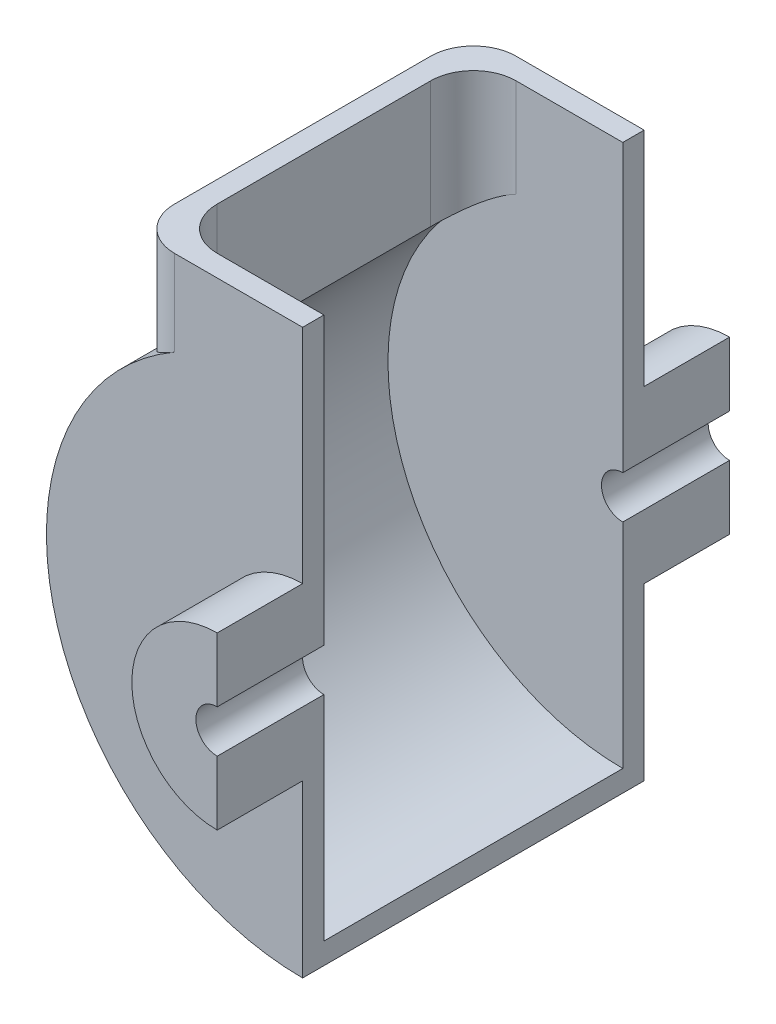
ISO-10303-21;
HEADER;
FILE_DESCRIPTION(('STEP AP214'),'2;1');
FILE_NAME('part.step','',(''),(''),'','','');
FILE_SCHEMA(('AUTOMOTIVE_DESIGN { 1 0 10303 214 1 1 1 1 }'));
ENDSEC;
DATA;
#1=APPLICATION_CONTEXT('core data for automotive mechanical design processes');
#2=APPLICATION_PROTOCOL_DEFINITION('international standard','automotive_design',2000,#1);
#3=PRODUCT_CONTEXT('',#1,'mechanical');
#4=PRODUCT('Part','Part','',(#3));
#5=PRODUCT_RELATED_PRODUCT_CATEGORY('part','',(#4));
#6=PRODUCT_DEFINITION_FORMATION('','',#4);
#7=PRODUCT_DEFINITION_CONTEXT('part definition',#1,'design');
#8=PRODUCT_DEFINITION('design','',#6,#7);
#9=PRODUCT_DEFINITION_SHAPE('','',#8);
#10=(LENGTH_UNIT() NAMED_UNIT(*) SI_UNIT(.MILLI.,.METRE.));
#11=(NAMED_UNIT(*) PLANE_ANGLE_UNIT() SI_UNIT($,.RADIAN.));
#12=(NAMED_UNIT(*) SI_UNIT($,.STERADIAN.) SOLID_ANGLE_UNIT());
#13=UNCERTAINTY_MEASURE_WITH_UNIT(LENGTH_MEASURE(1.E-05),#10,'distance_accuracy_value','');
#14=(GEOMETRIC_REPRESENTATION_CONTEXT(3) GLOBAL_UNCERTAINTY_ASSIGNED_CONTEXT((#13)) GLOBAL_UNIT_ASSIGNED_CONTEXT((#10,
#11,#12)) REPRESENTATION_CONTEXT('',''));
#15=CARTESIAN_POINT('',(0.,0.,0.));
#16=DIRECTION('',(0.,0.,1.));
#17=DIRECTION('',(1.,0.,0.));
#18=AXIS2_PLACEMENT_3D('',#15,#16,#17);
#19=CARTESIAN_POINT('',(0.,0.,0.));
#20=DIRECTION('',(0.,0.,1.));
#21=DIRECTION('',(1.,0.,0.));
#22=AXIS2_PLACEMENT_3D('',#19,#20,#21);
#23=PLANE('',#22);
#24=CARTESIAN_POINT('',(0.,0.,0.));
#25=DIRECTION('',(0.,0.,-1.));
#26=DIRECTION('',(-1.,0.,0.));
#27=AXIS2_PLACEMENT_3D('',#24,#25,#26);
#28=CIRCLE('',#27,55.);
#29=CARTESIAN_POINT('',(-25.,48.9897948556636,0.));
#30=VERTEX_POINT('',#29);
#31=CARTESIAN_POINT('',(0.,-55.,0.));
#32=VERTEX_POINT('',#31);
#33=EDGE_CURVE('E238',#30,#32,#28,.F.);
#34=ORIENTED_EDGE('',*,*,#33,.F.);
#35=DIRECTION('',(0.,-1.,0.));
#36=VECTOR('',#35,1.);
#37=CARTESIAN_POINT('',(-25.,72.,0.));
#38=LINE('',#37,#36);
#39=CARTESIAN_POINT('',(-25.,72.,0.));
#40=VERTEX_POINT('',#39);
#41=EDGE_CURVE('E312',#30,#40,#38,.F.);
#42=ORIENTED_EDGE('',*,*,#41,.T.);
#43=DIRECTION('',(-1.,0.,0.));
#44=VECTOR('',#43,1.);
#45=CARTESIAN_POINT('',(0.,72.,0.));
#46=LINE('',#45,#44);
#47=CARTESIAN_POINT('',(0.,72.,0.));
#48=VERTEX_POINT('',#47);
#49=EDGE_CURVE('E241',#48,#40,#46,.T.);
#50=ORIENTED_EDGE('',*,*,#49,.F.);
#51=DIRECTION('',(0.,1.,0.));
#52=VECTOR('',#51,1.);
#53=CARTESIAN_POINT('',(0.,20.,0.));
#54=LINE('',#53,#52);
#55=CARTESIAN_POINT('',(0.,5.,0.));
#56=VERTEX_POINT('',#55);
#57=EDGE_CURVE('E291',#56,#48,#54,.T.);
#58=ORIENTED_EDGE('',*,*,#57,.F.);
#59=CARTESIAN_POINT('',(0.,0.,0.));
#60=DIRECTION('',(0.,0.,-1.));
#61=DIRECTION('',(1.,0.,0.));
#62=AXIS2_PLACEMENT_3D('',#59,#60,#61);
#63=CIRCLE('',#62,5.);
#64=CARTESIAN_POINT('',(0.,-5.,0.));
#65=VERTEX_POINT('',#64);
#66=EDGE_CURVE('E277',#65,#56,#63,.T.);
#67=ORIENTED_EDGE('',*,*,#66,.F.);
#68=DIRECTION('',(0.,1.,0.));
#69=VECTOR('',#68,1.);
#70=CARTESIAN_POINT('',(0.,-5.,0.));
#71=LINE('',#70,#69);
#72=EDGE_CURVE('E282',#32,#65,#71,.T.);
#73=ORIENTED_EDGE('',*,*,#72,.F.);
#74=EDGE_LOOP('',(#34,#42,#50,#58,#67,#73));
#75=FACE_BOUND('',#74,.T.);
#76=ADVANCED_FACE('F33',(#75),#23,.F.);
#77=CARTESIAN_POINT('',(0.,0.,25.));
#78=DIRECTION('',(0.,0.,-1.));
#79=DIRECTION('',(-1.,0.,0.));
#80=AXIS2_PLACEMENT_3D('',#77,#78,#79);
#81=CYLINDRICAL_SURFACE('',#80,5.);
#82=ORIENTED_EDGE('',*,*,#66,.T.);
#83=DIRECTION('',(0.,0.,-1.));
#84=VECTOR('',#83,1.);
#85=CARTESIAN_POINT('',(0.,5.,25.));
#86=LINE('',#85,#84);
#87=CARTESIAN_POINT('',(0.,5.,25.));
#88=VERTEX_POINT('',#87);
#89=EDGE_CURVE('E301',#88,#56,#86,.T.);
#90=ORIENTED_EDGE('',*,*,#89,.F.);
#91=CARTESIAN_POINT('',(0.,0.,25.));
#92=DIRECTION('',(0.,0.,-1.));
#93=DIRECTION('',(1.,0.,0.));
#94=AXIS2_PLACEMENT_3D('',#91,#92,#93);
#95=CIRCLE('',#94,5.);
#96=CARTESIAN_POINT('',(0.,-5.,25.));
#97=VERTEX_POINT('',#96);
#98=EDGE_CURVE('E278',#97,#88,#95,.T.);
#99=ORIENTED_EDGE('',*,*,#98,.F.);
#100=DIRECTION('',(0.,0.,-1.));
#101=VECTOR('',#100,1.);
#102=CARTESIAN_POINT('',(0.,-5.,25.));
#103=LINE('',#102,#101);
#104=EDGE_CURVE('E288',#97,#65,#103,.T.);
#105=ORIENTED_EDGE('',*,*,#104,.T.);
#106=EDGE_LOOP('',(#82,#90,#99,#105));
#107=FACE_BOUND('',#106,.T.);
#108=ADVANCED_FACE('F347',(#107),#81,.F.);
#109=CARTESIAN_POINT('',(0.,20.,25.));
#110=DIRECTION('',(-1.,0.,0.));
#111=DIRECTION('',(0.,-1.,0.));
#112=AXIS2_PLACEMENT_3D('',#109,#110,#111);
#113=PLANE('',#112);
#114=ORIENTED_EDGE('',*,*,#57,.T.);
#115=DIRECTION('',(0.,0.,-1.));
#116=VECTOR('',#115,1.);
#117=CARTESIAN_POINT('',(0.,72.,5.));
#118=LINE('',#117,#116);
#119=CARTESIAN_POINT('',(0.,72.,5.));
#120=VERTEX_POINT('',#119);
#121=EDGE_CURVE('E274',#120,#48,#118,.T.);
#122=ORIENTED_EDGE('',*,*,#121,.F.);
#123=DIRECTION('',(0.,1.,0.));
#124=VECTOR('',#123,1.);
#125=CARTESIAN_POINT('',(0.,20.,5.));
#126=LINE('',#125,#124);
#127=CARTESIAN_POINT('',(0.,20.,5.));
#128=VERTEX_POINT('',#127);
#129=EDGE_CURVE('E256',#128,#120,#126,.T.);
#130=ORIENTED_EDGE('',*,*,#129,.F.);
#131=DIRECTION('',(0.,0.,-1.));
#132=VECTOR('',#131,1.);
#133=CARTESIAN_POINT('',(0.,20.,25.));
#134=LINE('',#133,#132);
#135=CARTESIAN_POINT('',(0.,20.,25.));
#136=VERTEX_POINT('',#135);
#137=EDGE_CURVE('E299',#136,#128,#134,.T.);
#138=ORIENTED_EDGE('',*,*,#137,.F.);
#139=DIRECTION('',(0.,1.,0.));
#140=VECTOR('',#139,1.);
#141=CARTESIAN_POINT('',(0.,20.,25.));
#142=LINE('',#141,#140);
#143=EDGE_CURVE('E281',#88,#136,#142,.T.);
#144=ORIENTED_EDGE('',*,*,#143,.F.);
#145=ORIENTED_EDGE('',*,*,#89,.T.);
#146=EDGE_LOOP('',(#114,#122,#130,#138,#144,#145));
#147=FACE_BOUND('',#146,.T.);
#148=ADVANCED_FACE('F393',(#147),#113,.F.);
#149=CARTESIAN_POINT('',(0.,0.,25.));
#150=DIRECTION('',(0.,0.,-1.));
#151=DIRECTION('',(-1.,0.,0.));
#152=AXIS2_PLACEMENT_3D('',#149,#150,#151);
#153=CYLINDRICAL_SURFACE('',#152,20.);
#154=ORIENTED_EDGE('',*,*,#137,.T.);
#155=CARTESIAN_POINT('',(0.,0.,5.));
#156=DIRECTION('',(0.,0.,-1.));
#157=DIRECTION('',(1.,0.,0.));
#158=AXIS2_PLACEMENT_3D('',#155,#156,#157);
#159=CIRCLE('',#158,20.);
#160=CARTESIAN_POINT('',(0.,-20.,5.));
#161=VERTEX_POINT('',#160);
#162=EDGE_CURVE('E253',#161,#128,#159,.T.);
#163=ORIENTED_EDGE('',*,*,#162,.F.);
#164=DIRECTION('',(0.,0.,-1.));
#165=VECTOR('',#164,1.);
#166=CARTESIAN_POINT('',(0.,-20.,25.));
#167=LINE('',#166,#165);
#168=CARTESIAN_POINT('',(0.,-20.,25.));
#169=VERTEX_POINT('',#168);
#170=EDGE_CURVE('E296',#169,#161,#167,.T.);
#171=ORIENTED_EDGE('',*,*,#170,.F.);
#172=CARTESIAN_POINT('',(0.,0.,25.));
#173=DIRECTION('',(0.,0.,1.));
#174=DIRECTION('',(1.,0.,0.));
#175=AXIS2_PLACEMENT_3D('',#172,#173,#174);
#176=CIRCLE('',#175,20.);
#177=EDGE_CURVE('E284',#136,#169,#176,.T.);
#178=ORIENTED_EDGE('',*,*,#177,.F.);
#179=EDGE_LOOP('',(#154,#163,#171,#178));
#180=FACE_BOUND('',#179,.T.);
#181=ADVANCED_FACE('F390',(#180),#153,.T.);
#182=CARTESIAN_POINT('',(0.,-5.,25.));
#183=DIRECTION('',(-1.,0.,0.));
#184=DIRECTION('',(0.,-1.,0.));
#185=AXIS2_PLACEMENT_3D('',#182,#183,#184);
#186=PLANE('',#185);
#187=DIRECTION('',(0.,0.,-1.));
#188=VECTOR('',#187,1.);
#189=CARTESIAN_POINT('',(0.,-60.,5.));
#190=LINE('',#189,#188);
#191=CARTESIAN_POINT('',(0.,-60.,5.));
#192=VERTEX_POINT('',#191);
#193=CARTESIAN_POINT('',(0.,-60.,-75.));
#194=VERTEX_POINT('',#193);
#195=EDGE_CURVE('E264',#192,#194,#190,.T.);
#196=ORIENTED_EDGE('',*,*,#195,.T.);
#197=DIRECTION('',(0.,1.,0.));
#198=VECTOR('',#197,1.);
#199=CARTESIAN_POINT('',(0.,-20.,-75.));
#200=LINE('',#199,#198);
#201=CARTESIAN_POINT('',(0.,-20.,-75.));
#202=VERTEX_POINT('',#201);
#203=EDGE_CURVE('E197',#194,#202,#200,.T.);
#204=ORIENTED_EDGE('',*,*,#203,.T.);
#205=DIRECTION('',(0.,0.,1.));
#206=VECTOR('',#205,1.);
#207=CARTESIAN_POINT('',(0.,-20.,-95.));
#208=LINE('',#207,#206);
#209=CARTESIAN_POINT('',(0.,-20.,-95.));
#210=VERTEX_POINT('',#209);
#211=EDGE_CURVE('E230',#210,#202,#208,.T.);
#212=ORIENTED_EDGE('',*,*,#211,.F.);
#213=DIRECTION('',(0.,1.,0.));
#214=VECTOR('',#213,1.);
#215=CARTESIAN_POINT('',(0.,-5.,-95.));
#216=LINE('',#215,#214);
#217=CARTESIAN_POINT('',(0.,-5.,-95.));
#218=VERTEX_POINT('',#217);
#219=EDGE_CURVE('E220',#210,#218,#216,.T.);
#220=ORIENTED_EDGE('',*,*,#219,.T.);
#221=DIRECTION('',(0.,0.,1.));
#222=VECTOR('',#221,1.);
#223=CARTESIAN_POINT('',(0.,-5.,-95.));
#224=LINE('',#223,#222);
#225=CARTESIAN_POINT('',(0.,-5.,-70.));
#226=VERTEX_POINT('',#225);
#227=EDGE_CURVE('E222',#218,#226,#224,.T.);
#228=ORIENTED_EDGE('',*,*,#227,.T.);
#229=DIRECTION('',(0.,1.,0.));
#230=VECTOR('',#229,1.);
#231=CARTESIAN_POINT('',(0.,-5.,-70.));
#232=LINE('',#231,#230);
#233=CARTESIAN_POINT('',(0.,-55.,-70.));
#234=VERTEX_POINT('',#233);
#235=EDGE_CURVE('E215',#234,#226,#232,.T.);
#236=ORIENTED_EDGE('',*,*,#235,.F.);
#237=DIRECTION('',(0.,0.,1.));
#238=VECTOR('',#237,1.);
#239=CARTESIAN_POINT('',(0.,-55.,-95.002));
#240=LINE('',#239,#238);
#241=EDGE_CURVE('E243',#234,#32,#240,.T.);
#242=ORIENTED_EDGE('',*,*,#241,.T.);
#243=ORIENTED_EDGE('',*,*,#72,.T.);
#244=ORIENTED_EDGE('',*,*,#104,.F.);
#245=DIRECTION('',(0.,1.,0.));
#246=VECTOR('',#245,1.);
#247=CARTESIAN_POINT('',(0.,-5.,25.));
#248=LINE('',#247,#246);
#249=EDGE_CURVE('E286',#169,#97,#248,.T.);
#250=ORIENTED_EDGE('',*,*,#249,.F.);
#251=ORIENTED_EDGE('',*,*,#170,.T.);
#252=DIRECTION('',(0.,1.,0.));
#253=VECTOR('',#252,1.);
#254=CARTESIAN_POINT('',(0.,-20.,5.));
#255=LINE('',#254,#253);
#256=EDGE_CURVE('E261',#192,#161,#255,.T.);
#257=ORIENTED_EDGE('',*,*,#256,.F.);
#258=EDGE_LOOP('',(#196,#204,#212,#220,#228,#236,#242,#243,#244,#250,#251,#257));
#259=FACE_BOUND('',#258,.T.);
#260=ADVANCED_FACE('F383',(#259),#186,.F.);
#261=CARTESIAN_POINT('',(0.,0.,25.));
#262=DIRECTION('',(0.,0.,1.));
#263=DIRECTION('',(1.,0.,0.));
#264=AXIS2_PLACEMENT_3D('',#261,#262,#263);
#265=PLANE('',#264);
#266=ORIENTED_EDGE('',*,*,#98,.T.);
#267=ORIENTED_EDGE('',*,*,#143,.T.);
#268=ORIENTED_EDGE('',*,*,#177,.T.);
#269=ORIENTED_EDGE('',*,*,#249,.T.);
#270=EDGE_LOOP('',(#266,#267,#268,#269));
#271=FACE_BOUND('',#270,.T.);
#272=ADVANCED_FACE('F380',(#271),#265,.T.);
#273=CARTESIAN_POINT('',(0.,72.,5.));
#274=DIRECTION('',(0.,-1.,0.));
#275=DIRECTION('',(1.,0.,0.));
#276=AXIS2_PLACEMENT_3D('',#273,#274,#275);
#277=PLANE('',#276);
#278=DIRECTION('',(-1.,0.,0.));
#279=VECTOR('',#278,1.);
#280=CARTESIAN_POINT('',(0.,72.,-75.));
#281=LINE('',#280,#279);
#282=CARTESIAN_POINT('',(0.,72.,-75.));
#283=VERTEX_POINT('',#282);
#284=CARTESIAN_POINT('',(-30.,72.,-75.));
#285=VERTEX_POINT('',#284);
#286=EDGE_CURVE('E177',#283,#285,#281,.T.);
#287=ORIENTED_EDGE('',*,*,#286,.T.);
#288=CARTESIAN_POINT('',(-30.,72.,-65.));
#289=DIRECTION('',(0.,-1.,0.));
#290=DIRECTION('',(1.,0.,0.));
#291=AXIS2_PLACEMENT_3D('',#288,#289,#290);
#292=CIRCLE('',#291,10.);
#293=CARTESIAN_POINT('',(-40.,72.,-65.));
#294=VERTEX_POINT('',#293);
#295=EDGE_CURVE('E321',#285,#294,#292,.F.);
#296=ORIENTED_EDGE('',*,*,#295,.T.);
#297=DIRECTION('',(0.,0.,-1.));
#298=VECTOR('',#297,1.);
#299=CARTESIAN_POINT('',(-40.,72.,5.));
#300=LINE('',#299,#298);
#301=CARTESIAN_POINT('',(-40.,72.,-5.));
#302=VERTEX_POINT('',#301);
#303=EDGE_CURVE('E271',#302,#294,#300,.T.);
#304=ORIENTED_EDGE('',*,*,#303,.F.);
#305=CARTESIAN_POINT('',(-30.,72.,-5.));
#306=DIRECTION('',(0.,-1.,0.));
#307=DIRECTION('',(1.,0.,0.));
#308=AXIS2_PLACEMENT_3D('',#305,#306,#307);
#309=CIRCLE('',#308,10.);
#310=CARTESIAN_POINT('',(-30.,72.,5.));
#311=VERTEX_POINT('',#310);
#312=EDGE_CURVE('E61',#302,#311,#309,.F.);
#313=ORIENTED_EDGE('',*,*,#312,.T.);
#314=DIRECTION('',(-1.,0.,0.));
#315=VECTOR('',#314,1.);
#316=CARTESIAN_POINT('',(0.,72.,5.));
#317=LINE('',#316,#315);
#318=EDGE_CURVE('E258',#120,#311,#317,.T.);
#319=ORIENTED_EDGE('',*,*,#318,.F.);
#320=ORIENTED_EDGE('',*,*,#121,.T.);
#321=ORIENTED_EDGE('',*,*,#49,.T.);
#322=CARTESIAN_POINT('',(-25.,72.,-9.99999999999999));
#323=DIRECTION('',(0.,-1.,0.));
#324=DIRECTION('',(1.,0.,0.));
#325=AXIS2_PLACEMENT_3D('',#322,#323,#324);
#326=CIRCLE('',#325,10.);
#327=CARTESIAN_POINT('',(-35.,72.,-9.99999999999999));
#328=VERTEX_POINT('',#327);
#329=EDGE_CURVE('E361',#40,#328,#326,.T.);
#330=ORIENTED_EDGE('',*,*,#329,.T.);
#331=DIRECTION('',(0.,0.,1.));
#332=VECTOR('',#331,1.);
#333=CARTESIAN_POINT('',(-35.,72.,-95.002));
#334=LINE('',#333,#332);
#335=CARTESIAN_POINT('',(-35.,72.,-60.));
#336=VERTEX_POINT('',#335);
#337=EDGE_CURVE('E246',#336,#328,#334,.T.);
#338=ORIENTED_EDGE('',*,*,#337,.F.);
#339=CARTESIAN_POINT('',(-25.,72.,-60.));
#340=DIRECTION('',(0.,-1.,0.));
#341=DIRECTION('',(1.,0.,0.));
#342=AXIS2_PLACEMENT_3D('',#339,#340,#341);
#343=CIRCLE('',#342,10.);
#344=CARTESIAN_POINT('',(-25.,72.,-70.));
#345=VERTEX_POINT('',#344);
#346=EDGE_CURVE('E334',#336,#345,#343,.T.);
#347=ORIENTED_EDGE('',*,*,#346,.T.);
#348=DIRECTION('',(-1.,0.,0.));
#349=VECTOR('',#348,1.);
#350=CARTESIAN_POINT('',(0.,72.,-70.));
#351=LINE('',#350,#349);
#352=CARTESIAN_POINT('',(0.,72.,-70.));
#353=VERTEX_POINT('',#352);
#354=EDGE_CURVE('E193',#353,#345,#351,.T.);
#355=ORIENTED_EDGE('',*,*,#354,.F.);
#356=DIRECTION('',(0.,0.,1.));
#357=VECTOR('',#356,1.);
#358=CARTESIAN_POINT('',(0.,72.,-75.));
#359=LINE('',#358,#357);
#360=EDGE_CURVE('E190',#283,#353,#359,.T.);
#361=ORIENTED_EDGE('',*,*,#360,.F.);
#362=EDGE_LOOP('',(#287,#296,#304,#313,#319,#320,#321,#330,#338,#347,#355,#361));
#363=FACE_BOUND('',#362,.T.);
#364=ADVANCED_FACE('F191',(#363),#277,.F.);
#365=CARTESIAN_POINT('',(-40.,72.,5.));
#366=DIRECTION('',(1.,0.,0.));
#367=DIRECTION('',(0.,0.,-1.));
#368=AXIS2_PLACEMENT_3D('',#365,#366,#367);
#369=PLANE('',#368);
#370=ORIENTED_EDGE('',*,*,#303,.T.);
#371=DIRECTION('',(0.,-1.,0.));
#372=VECTOR('',#371,1.);
#373=CARTESIAN_POINT('',(-40.,44.7213595499958,-65.));
#374=LINE('',#373,#372);
#375=CARTESIAN_POINT('',(-40.,44.7213595499958,-65.));
#376=VERTEX_POINT('',#375);
#377=EDGE_CURVE('E316',#294,#376,#374,.T.);
#378=ORIENTED_EDGE('',*,*,#377,.T.);
#379=DIRECTION('',(0.,0.,-1.));
#380=VECTOR('',#379,1.);
#381=CARTESIAN_POINT('',(-40.,44.7213595499958,5.));
#382=LINE('',#381,#380);
#383=CARTESIAN_POINT('',(-40.,44.7213595499958,-5.));
#384=VERTEX_POINT('',#383);
#385=EDGE_CURVE('E268',#384,#376,#382,.T.);
#386=ORIENTED_EDGE('',*,*,#385,.F.);
#387=DIRECTION('',(0.,-1.,0.));
#388=VECTOR('',#387,1.);
#389=CARTESIAN_POINT('',(-40.,72.,-5.));
#390=LINE('',#389,#388);
#391=EDGE_CURVE('E314',#384,#302,#390,.F.);
#392=ORIENTED_EDGE('',*,*,#391,.T.);
#393=EDGE_LOOP('',(#370,#378,#386,#392));
#394=FACE_BOUND('',#393,.T.);
#395=ADVANCED_FACE('F373',(#394),#369,.F.);
#396=CARTESIAN_POINT('',(0.,0.,5.));
#397=DIRECTION('',(0.,0.,-1.));
#398=DIRECTION('',(-1.,0.,0.));
#399=AXIS2_PLACEMENT_3D('',#396,#397,#398);
#400=CYLINDRICAL_SURFACE('',#399,60.);
#401=CARTESIAN_POINT('',(0.,0.,5.));
#402=DIRECTION('',(0.,0.,1.));
#403=DIRECTION('',(1.,0.,0.));
#404=AXIS2_PLACEMENT_3D('',#401,#402,#403);
#405=CIRCLE('',#404,60.);
#406=CARTESIAN_POINT('',(-30.,51.9615242270663,5.));
#407=VERTEX_POINT('',#406);
#408=EDGE_CURVE('E53',#407,#192,#405,.T.);
#409=ORIENTED_EDGE('',*,*,#408,.F.);
#410=CARTESIAN_POINT('',(-30.,51.9615242270663,5.));
#411=CARTESIAN_POINT('',(-30.1846403402756,51.8549243575684,4.99999694467445));
#412=CARTESIAN_POINT('',(-30.3686755821332,51.7473565843307,4.99488587812623));
#413=CARTESIAN_POINT('',(-30.7351668388072,51.5305231450817,4.97462918627216));
#414=CARTESIAN_POINT('',(-30.9176229894396,51.4212576273974,4.95948443281986));
#415=CARTESIAN_POINT('',(-31.4619253243051,51.0913595980358,4.89929167200636));
#416=CARTESIAN_POINT('',(-31.8209014856786,50.868512343648,4.83948477245505));
#417=CARTESIAN_POINT('',(-32.5288887310146,50.418725257113,4.68176841927459));
#418=CARTESIAN_POINT('',(-32.8778736192083,50.1917768316845,4.5837671788936));
#419=CARTESIAN_POINT('',(-33.562476910193,49.7365966241752,4.35090696893926));
#420=CARTESIAN_POINT('',(-33.8980954977704,49.5083648598862,4.21604850911225));
#421=CARTESIAN_POINT('',(-34.5207296024579,49.0759439346811,3.92574534472068));
#422=CARTESIAN_POINT('',(-34.8092512536601,48.8716304811259,3.77370267176126));
#423=CARTESIAN_POINT('',(-35.3716903107987,48.4661085573826,3.44107089228342));
#424=CARTESIAN_POINT('',(-35.6456079007732,48.2649000480893,3.26048214561176));
#425=CARTESIAN_POINT('',(-36.1765727574088,47.8682074936152,2.87135112309205));
#426=CARTESIAN_POINT('',(-36.4336405194033,47.6727166603459,2.66284378257167));
#427=CARTESIAN_POINT('',(-36.9290721152615,47.289972828363,2.21794621899144));
#428=CARTESIAN_POINT('',(-37.167441451851,47.1027174132443,1.98156425075618));
#429=CARTESIAN_POINT('',(-37.565018182153,46.785859634165,1.54478146403292));
#430=CARTESIAN_POINT('',(-37.7289458526818,46.6537017113221,1.35050833176437));
#431=CARTESIAN_POINT('',(-38.0437650386959,46.397339573439,0.946710505836691));
#432=CARTESIAN_POINT('',(-38.1946575996422,46.2731347207424,0.737187037795451));
#433=CARTESIAN_POINT('',(-38.4818360085844,46.0345861261904,0.303399948510743));
#434=CARTESIAN_POINT('',(-38.618136880254,45.9202322658759,0.0791518792914404));
#435=CARTESIAN_POINT('',(-38.8746918035924,45.7032445431668,-0.383743447816962));
#436=CARTESIAN_POINT('',(-38.9949492411763,45.6006082084878,-0.62238765196006));
#437=CARTESIAN_POINT('',(-39.1965662504922,45.4273417305266,-1.06669402634214));
#438=CARTESIAN_POINT('',(-39.2809795718102,45.3543309967536,-1.27004581930021));
#439=CARTESIAN_POINT('',(-39.437114382813,45.2186323209963,-1.68488791321454));
#440=CARTESIAN_POINT('',(-39.508838494378,45.1559422467147,-1.89637652189831));
#441=CARTESIAN_POINT('',(-39.6385128100447,45.0421551914612,-2.32617263610176));
#442=CARTESIAN_POINT('',(-39.6964869139818,44.9910381018204,-2.54446755239788));
#443=CARTESIAN_POINT('',(-39.7978943535571,44.9013606141582,-2.98685266600599));
#444=CARTESIAN_POINT('',(-39.8413328734582,44.8627957393971,-3.21094076633609));
#445=CARTESIAN_POINT('',(-39.9177189665931,44.7948514731765,-3.6937744282411));
#446=CARTESIAN_POINT('',(-39.9484884415043,44.7673886419263,-3.95314914513774));
#447=CARTESIAN_POINT('',(-39.9793476433001,44.7398248250479,-4.34440444684136));
#448=CARTESIAN_POINT('',(-39.987084921451,44.7329085695169,-4.47527578752073));
#449=CARTESIAN_POINT('',(-39.9974129661721,44.7236736235071,-4.73742237599204));
#450=CARTESIAN_POINT('',(-40.0000021863485,44.7213563144782,-4.86869773328782));
#451=CARTESIAN_POINT('',(-40.,44.7213595499958,-5.));
#452=B_SPLINE_CURVE_WITH_KNOTS('',3,(#410,#411,#412,#413,#414,#415,#416,#417,#418,#419,#420,
#421,#422,#423,#424,#425,#426,#427,#428,#429,#430,#431,#432,#433,#434,#435,#436,#437,#438,#439,
#440,#441,#442,#443,#444,#445,#446,#447,#448,#449,#450,#451),.UNSPECIFIED.,.F.,.F.,(4,2,2,2,2,2,
2,2,2,2,2,2,2,2,2,2,2,2,2,2,4),(0.,0.639469988122809,1.27888441829631,2.5570367234409,
3.83827975129429,5.11950506007103,6.27274736359202,7.42597513070352,8.5777730871098,
9.72923080131073,10.5879927572485,11.4466857734357,12.3044859953459,13.1621048939207,
13.8573439066469,14.5524390989254,15.2463170957639,15.9399473495783,16.7262834977137,
17.1199731890566,17.5137811205932),.UNSPECIFIED.);
#453=EDGE_CURVE('E11',#407,#384,#452,.T.);
#454=ORIENTED_EDGE('',*,*,#453,.T.);
#455=ORIENTED_EDGE('',*,*,#385,.T.);
#456=CARTESIAN_POINT('',(-40.,44.7213595499958,-65.));
#457=CARTESIAN_POINT('',(-40.0000015812733,44.7213573011344,-65.1176634010021));
#458=CARTESIAN_POINT('',(-39.9979227141808,44.7232176305845,-65.2353086549857));
#459=CARTESIAN_POINT('',(-39.9896253110866,44.7306372942271,-65.4703286016599));
#460=CARTESIAN_POINT('',(-39.9834070494192,44.7361963832882,-65.5877033117632));
#461=CARTESIAN_POINT('',(-39.9585923280535,44.7583670958171,-65.9388427467586));
#462=CARTESIAN_POINT('',(-39.9338358355778,44.7804722797486,-66.1718758054602));
#463=CARTESIAN_POINT('',(-39.8686644525486,44.8385042167555,-66.6318691326489));
#464=CARTESIAN_POINT('',(-39.8283855148164,44.8743109465834,-66.8588643223737));
#465=CARTESIAN_POINT('',(-39.7328892662281,44.9588875680342,-67.3072524479117));
#466=CARTESIAN_POINT('',(-39.6776696039361,45.0076595001554,-67.5286444958756));
#467=CARTESIAN_POINT('',(-39.5534118644793,45.1168972505339,-67.9636688649734));
#468=CARTESIAN_POINT('',(-39.4844211995899,45.1773229225701,-68.1773249178853));
#469=CARTESIAN_POINT('',(-39.3334605195833,45.3088170177995,-68.5966936542645));
#470=CARTESIAN_POINT('',(-39.2514857085459,45.3798893730022,-68.8024033675523));
#471=CARTESIAN_POINT('',(-39.0753863002099,45.5316122169457,-69.2054529377369));
#472=CARTESIAN_POINT('',(-38.9812363061758,45.6122826978885,-69.4027741200324));
#473=CARTESIAN_POINT('',(-38.7818943790383,45.7818938454653,-69.788046749896));
#474=CARTESIAN_POINT('',(-38.6767013504078,45.8708353325264,-69.9759972651116));
#475=CARTESIAN_POINT('',(-38.4135728743112,46.0916172160901,-70.4129070483267));
#476=CARTESIAN_POINT('',(-38.2509572804995,46.2267600621542,-70.6573967975822));
#477=CARTESIAN_POINT('',(-37.908447036405,46.5080507377658,-71.1270697633622));
#478=CARTESIAN_POINT('',(-37.7285517130429,46.6541989959475,-71.3522522271834));
#479=CARTESIAN_POINT('',(-37.3531054007839,46.9553345195759,-71.783333742699));
#480=CARTESIAN_POINT('',(-37.1575367002328,47.1103317262239,-71.9892103913973));
#481=CARTESIAN_POINT('',(-36.7525951751676,47.4269223387039,-72.3811838692743));
#482=CARTESIAN_POINT('',(-36.5432234671629,47.5885152106185,-72.5672822951176));
#483=CARTESIAN_POINT('',(-35.889352420626,48.0859277319981,-73.1015951815724));
#484=CARTESIAN_POINT('',(-35.4251261289153,48.429498559668,-73.4189829871174));
#485=CARTESIAN_POINT('',(-34.4553726874119,49.1241578823887,-73.9699716496598));
#486=CARTESIAN_POINT('',(-33.9498747171002,49.4752409388269,-74.2036310842669));
#487=CARTESIAN_POINT('',(-33.1568278633415,50.0073212539565,-74.4930456878643));
#488=CARTESIAN_POINT('',(-32.8810021018505,50.1891501210001,-74.5803819665683));
#489=CARTESIAN_POINT('',(-32.3217375725054,50.5511235483305,-74.7310524671282));
#490=CARTESIAN_POINT('',(-32.0382991780871,50.7312681906542,-74.7943878640466));
#491=CARTESIAN_POINT('',(-31.4650006560554,51.0888227050653,-74.8963939978526));
#492=CARTESIAN_POINT('',(-31.1751356203563,51.2662302982853,-74.935045161166));
#493=CARTESIAN_POINT('',(-30.5906934832528,51.6171131325133,-74.9868485137105));
#494=CARTESIAN_POINT('',(-30.2961152167169,51.7905873747387,-74.9999942965489));
#495=CARTESIAN_POINT('',(-30.,51.9615242270663,-75.));
#496=B_SPLINE_CURVE_WITH_KNOTS('',3,(#456,#457,#458,#459,#460,#461,#462,#463,#464,#465,#466,
#467,#468,#469,#470,#471,#472,#473,#474,#475,#476,#477,#478,#479,#480,#481,#482,#483,#484,#485,
#486,#487,#488,#489,#490,#491,#492,#493,#494,#495),.UNSPECIFIED.,.F.,.F.,(4,2,2,2,2,2,2,2,2,2,2,
2,2,2,2,2,2,2,2,4),(0.,0.352921378883185,0.705819370583158,1.41085932128629,2.10985961734753,
2.80896998914977,3.50571366437716,4.20271529673452,4.90119502233958,5.59974410640154,
6.56805788163332,7.53640938987801,8.50587104319846,9.47525437387456,11.4447404103531,
13.4128458625583,14.4372042618812,15.4615125030147,16.4866319729198,17.5120088970541),.UNSPECIFIED.);
#497=CARTESIAN_POINT('',(-30.,51.9615242270663,-75.));
#498=VERTEX_POINT('',#497);
#499=EDGE_CURVE('E47',#376,#498,#496,.T.);
#500=ORIENTED_EDGE('',*,*,#499,.T.);
#501=CARTESIAN_POINT('',(0.,0.,-75.));
#502=DIRECTION('',(0.,0.,1.));
#503=DIRECTION('',(1.,0.,0.));
#504=AXIS2_PLACEMENT_3D('',#501,#502,#503);
#505=CIRCLE('',#504,60.);
#506=EDGE_CURVE('E187',#498,#194,#505,.T.);
#507=ORIENTED_EDGE('',*,*,#506,.T.);
#508=ORIENTED_EDGE('',*,*,#195,.F.);
#509=EDGE_LOOP('',(#409,#454,#455,#500,#507,#508));
#510=FACE_BOUND('',#509,.T.);
#511=ADVANCED_FACE('F367',(#510),#400,.T.);
#512=CARTESIAN_POINT('',(0.,0.,5.));
#513=DIRECTION('',(0.,0.,1.));
#514=DIRECTION('',(1.,0.,0.));
#515=AXIS2_PLACEMENT_3D('',#512,#513,#514);
#516=PLANE('',#515);
#517=ORIENTED_EDGE('',*,*,#318,.T.);
#518=DIRECTION('',(0.,-1.,0.));
#519=VECTOR('',#518,1.);
#520=CARTESIAN_POINT('',(-30.,44.7213595499958,5.));
#521=LINE('',#520,#519);
#522=EDGE_CURVE('E323',#311,#407,#521,.T.);
#523=ORIENTED_EDGE('',*,*,#522,.T.);
#524=ORIENTED_EDGE('',*,*,#408,.T.);
#525=ORIENTED_EDGE('',*,*,#256,.T.);
#526=ORIENTED_EDGE('',*,*,#162,.T.);
#527=ORIENTED_EDGE('',*,*,#129,.T.);
#528=EDGE_LOOP('',(#517,#523,#524,#525,#526,#527));
#529=FACE_BOUND('',#528,.T.);
#530=ADVANCED_FACE('F372',(#529),#516,.T.);
#531=CARTESIAN_POINT('',(0.,0.,-95.002));
#532=DIRECTION('',(0.,0.,1.));
#533=DIRECTION('',(1.,0.,0.));
#534=AXIS2_PLACEMENT_3D('',#531,#532,#533);
#535=CYLINDRICAL_SURFACE('',#534,55.);
#536=CARTESIAN_POINT('',(0.,0.,-70.));
#537=DIRECTION('',(0.,0.,-1.));
#538=DIRECTION('',(-1.,0.,0.));
#539=AXIS2_PLACEMENT_3D('',#536,#537,#538);
#540=CIRCLE('',#539,55.);
#541=CARTESIAN_POINT('',(-25.,48.9897948556636,-70.));
#542=VERTEX_POINT('',#541);
#543=EDGE_CURVE('E237',#542,#234,#540,.F.);
#544=ORIENTED_EDGE('',*,*,#543,.F.);
#545=CARTESIAN_POINT('',(-25.,48.9897948556636,-70.));
#546=CARTESIAN_POINT('',(-25.1906704625853,48.8924964907343,-69.9999971656189));
#547=CARTESIAN_POINT('',(-25.3807299051036,48.7941008127997,-69.9945462068009));
#548=CARTESIAN_POINT('',(-25.7591946792121,48.5953653194177,-69.9729416657178));
#549=CARTESIAN_POINT('',(-25.947600172291,48.4950256969118,-69.9567891403815));
#550=CARTESIAN_POINT('',(-26.5095199627771,48.1915584402701,-69.8925935595296));
#551=CARTESIAN_POINT('',(-26.879966617226,47.985865462464,-69.8288120264318));
#552=CARTESIAN_POINT('',(-27.6092367230561,47.5700172433392,-69.6608532752705));
#553=CARTESIAN_POINT('',(-27.9680515865194,47.3598588865119,-69.5566469152987));
#554=CARTESIAN_POINT('',(-28.6708870947942,46.9377053718885,-69.3093143170567));
#555=CARTESIAN_POINT('',(-29.0149087495746,46.7257103406777,-69.1661907406623));
#556=CARTESIAN_POINT('',(-29.6343122240442,46.3348745882726,-68.8669502099571));
#557=CARTESIAN_POINT('',(-29.9121762835488,46.1558947290866,-68.7161192793689));
#558=CARTESIAN_POINT('',(-30.453564058984,45.8004938086764,-68.3880155176435));
#559=CARTESIAN_POINT('',(-30.7170889667725,45.6240725356815,-68.210744888747));
#560=CARTESIAN_POINT('',(-31.2277793899634,45.27605554075,-67.8304558145634));
#561=CARTESIAN_POINT('',(-31.4749603097885,45.1044553652141,-67.6274621555615));
#562=CARTESIAN_POINT('',(-31.9512644556701,44.7683103206218,-67.1960491883292));
#563=CARTESIAN_POINT('',(-32.1803914213147,44.60376399371,-66.9676351692916));
#564=CARTESIAN_POINT('',(-32.5724334975713,44.3179704705642,-66.536394282226));
#565=CARTESIAN_POINT('',(-32.7391594522469,44.1948776144083,-66.3382416976568));
#566=CARTESIAN_POINT('',(-33.0586989979014,43.956366411861,-65.9266540781595));
#567=CARTESIAN_POINT('',(-33.2115135789464,43.8409475194751,-65.7132201327334));
#568=CARTESIAN_POINT('',(-33.5016809731427,43.6196131502261,-65.2717299317311));
#569=CARTESIAN_POINT('',(-33.6390478315194,43.5136890586718,-65.0436872596241));
#570=CARTESIAN_POINT('',(-33.8968966266417,43.3131282626193,-64.5735187782177));
#571=CARTESIAN_POINT('',(-34.0173818752135,43.2184893447453,-64.3313957444228));
#572=CARTESIAN_POINT('',(-34.220345560487,43.0578872759331,-63.8775967975981));
#573=CARTESIAN_POINT('',(-34.3057864350373,42.9898029979803,-63.6679931294044));
#574=CARTESIAN_POINT('',(-34.4630420236251,42.8638412603264,-63.2407750890927));
#575=CARTESIAN_POINT('',(-34.534859392632,42.805961812048,-63.023162287697));
#576=CARTESIAN_POINT('',(-34.6638213670323,42.7015968076424,-62.5813588577465));
#577=CARTESIAN_POINT('',(-34.7209903361364,42.6550923381947,-62.357179851681));
#578=CARTESIAN_POINT('',(-34.8199345283325,42.5743613090907,-61.9033665270967));
#579=CARTESIAN_POINT('',(-34.8617157478199,42.5401299669028,-61.6737343708085));
#580=CARTESIAN_POINT('',(-34.9300837462733,42.4840120509156,-61.2045822520297));
#581=CARTESIAN_POINT('',(-34.9562545186649,42.4624636500731,-60.9649596154708));
#582=CARTESIAN_POINT('',(-34.9824752970613,42.4408592306511,-60.6039690758757));
#583=CARTESIAN_POINT('',(-34.9890430057937,42.4354441063026,-60.4833431270819));
#584=CARTESIAN_POINT('',(-34.9978062165354,42.4282167617888,-60.241817657905));
#585=CARTESIAN_POINT('',(-35.0000014553635,42.4264047584974,-60.120918121493));
#586=CARTESIAN_POINT('',(-35.,42.4264068711928,-60.));
#587=B_SPLINE_CURVE_WITH_KNOTS('',3,(#545,#546,#547,#548,#549,#550,#551,#552,#553,#554,#555,
#556,#557,#558,#559,#560,#561,#562,#563,#564,#565,#566,#567,#568,#569,#570,#571,#572,#573,#574,
#575,#576,#577,#578,#579,#580,#581,#582,#583,#584,#585,#586),.UNSPECIFIED.,.F.,.F.,(4,2,2,2,2,2,
2,2,2,2,2,2,2,2,2,2,2,2,2,2,4),(0.,0.642025153546947,1.28398690760974,2.56714249695266,
3.85122482619341,5.13521934832298,6.22394893506149,7.31258788888127,8.40018571330232,
9.4875576637522,10.3469757139952,11.2063325519534,12.0649016266237,12.9233020310802,
13.6317123054177,14.3399843815419,15.0470706749441,15.7538811342204,16.4787715527391,
16.8414339261366,17.2041181277167),.UNSPECIFIED.);
#588=CARTESIAN_POINT('',(-35.,42.4264068711928,-60.));
#589=VERTEX_POINT('',#588);
#590=EDGE_CURVE('E326',#542,#589,#587,.T.);
#591=ORIENTED_EDGE('',*,*,#590,.T.);
#592=DIRECTION('',(0.,0.,1.));
#593=VECTOR('',#592,1.);
#594=CARTESIAN_POINT('',(-35.,42.4264068711928,-95.002));
#595=LINE('',#594,#593);
#596=CARTESIAN_POINT('',(-35.,42.4264068711928,-9.99999999999999));
#597=VERTEX_POINT('',#596);
#598=EDGE_CURVE('E242',#589,#597,#595,.T.);
#599=ORIENTED_EDGE('',*,*,#598,.T.);
#600=CARTESIAN_POINT('',(-35.,42.4264068711928,-9.99999999999999));
#601=CARTESIAN_POINT('',(-35.0000014497964,42.4264047837681,-9.87987310315719));
#602=CARTESIAN_POINT('',(-34.9978348514331,42.4281931348836,-9.75976422715493));
#603=CARTESIAN_POINT('',(-34.9891857816154,42.4353263709232,-9.51981491367695));
#604=CARTESIAN_POINT('',(-34.9827035721487,42.4406710399539,-9.39997446034919));
#605=CARTESIAN_POINT('',(-34.956830452997,42.4619893413881,-9.04141786262552));
#606=CARTESIAN_POINT('',(-34.9310129679865,42.4832473662838,-8.80342910014089));
#607=CARTESIAN_POINT('',(-34.8629816882097,42.5390927002779,-8.33339460407183));
#608=CARTESIAN_POINT('',(-34.8208989195309,42.5735734756723,-8.10131678852098));
#609=CARTESIAN_POINT('',(-34.7210380015034,42.6550543990627,-7.64278126517026));
#610=CARTESIAN_POINT('',(-34.6632576605496,42.7020562951679,-7.4163243469495));
#611=CARTESIAN_POINT('',(-34.5330883120894,42.807391745231,-6.97116269404727));
#612=CARTESIAN_POINT('',(-34.4607440027141,42.865690607765,-6.75243659053953));
#613=CARTESIAN_POINT('',(-34.3022805482754,42.9926022625577,-6.32304828482198));
#614=CARTESIAN_POINT('',(-34.2161564051557,43.061218796573,-6.11238904301828));
#615=CARTESIAN_POINT('',(-34.03096608752,43.2077227263221,-5.69966121720985));
#616=CARTESIAN_POINT('',(-33.9318751543174,43.2856278316291,-5.49761007347531));
#617=CARTESIAN_POINT('',(-33.7218564369498,43.4494435165854,-5.10314735561813));
#618=CARTESIAN_POINT('',(-33.610927467307,43.535354897885,-4.91073674975316));
#619=CARTESIAN_POINT('',(-33.3379150398717,43.7449695332966,-4.47123433911837));
#620=CARTESIAN_POINT('',(-33.1713989056376,43.87147497144,-4.22821699400697));
#621=CARTESIAN_POINT('',(-32.820669795309,44.1344729444258,-3.76121521493266));
#622=CARTESIAN_POINT('',(-32.6364569574066,44.2709654012783,-3.53723063237016));
#623=CARTESIAN_POINT('',(-32.2518815980921,44.5519118289509,-3.10846762196946));
#624=CARTESIAN_POINT('',(-32.0515019123395,44.6963742086041,-2.90371011997531));
#625=CARTESIAN_POINT('',(-31.6364068995163,44.9911403692426,-2.5140694607911));
#626=CARTESIAN_POINT('',(-31.4216926181168,45.1414437238107,-2.32918485648769));
#627=CARTESIAN_POINT('',(-30.7527718961723,45.6022087667656,-1.80053893105145));
#628=CARTESIAN_POINT('',(-30.2782224789075,45.9192504365907,-1.4876819776076));
#629=CARTESIAN_POINT('',(-29.2863950159429,46.5580783691839,-0.947634918697291));
#630=CARTESIAN_POINT('',(-28.7691524751348,46.8798605102554,-0.720374486477762));
#631=CARTESIAN_POINT('',(-27.9782964577458,47.3529868290529,-0.449937168922881));
#632=CARTESIAN_POINT('',(-27.71720700781,47.5063120740257,-0.372373069617562));
#633=CARTESIAN_POINT('',(-27.1884092746343,47.8109125009315,-0.238585466265289));
#634=CARTESIAN_POINT('',(-26.9207016309538,47.9621878787861,-0.182359908655269));
#635=CARTESIAN_POINT('',(-26.379727809034,48.2618435343977,-0.0918406003391308));
#636=CARTESIAN_POINT('',(-26.1064574293253,48.4102214444596,-0.0575641135549306));
#637=CARTESIAN_POINT('',(-25.5558838504953,48.703127245693,-0.011640079605015));
#638=CARTESIAN_POINT('',(-25.2785794886699,48.8476539914468,8.07737825414658E-07));
#639=CARTESIAN_POINT('',(-25.,48.9897948556636,0.));
#640=B_SPLINE_CURVE_WITH_KNOTS('',3,(#600,#601,#602,#603,#604,#605,#606,#607,#608,#609,#610,
#611,#612,#613,#614,#615,#616,#617,#618,#619,#620,#621,#622,#623,#624,#625,#626,#627,#628,#629,
#630,#631,#632,#633,#634,#635,#636,#637,#638,#639),.UNSPECIFIED.,.F.,.F.,(4,2,2,2,2,2,2,2,2,2,2,
2,2,2,2,2,2,2,2,4),(0.,0.360312293922661,0.720602716369276,1.44047421081293,2.15466369102644,
2.86895293355912,3.58108249267798,4.29347093489964,5.00724001410331,5.72108063834975,
6.68154144938632,7.64199476087041,8.60348155414834,9.56489828596206,11.5096170735251,
13.4527345617431,14.3897475989406,15.326670437678,16.2643293057158,17.2022640090674),.UNSPECIFIED.);
#641=EDGE_CURVE('E354',#597,#30,#640,.T.);
#642=ORIENTED_EDGE('',*,*,#641,.T.);
#643=ORIENTED_EDGE('',*,*,#33,.T.);
#644=ORIENTED_EDGE('',*,*,#241,.F.);
#645=EDGE_LOOP('',(#544,#591,#599,#642,#643,#644));
#646=FACE_BOUND('',#645,.T.);
#647=ADVANCED_FACE('F336',(#646),#535,.F.);
#648=CARTESIAN_POINT('',(-35.,72.,-95.002));
#649=DIRECTION('',(-1.,0.,0.));
#650=DIRECTION('',(0.,0.,1.));
#651=AXIS2_PLACEMENT_3D('',#648,#649,#650);
#652=PLANE('',#651);
#653=ORIENTED_EDGE('',*,*,#598,.F.);
#654=DIRECTION('',(0.,-1.,0.));
#655=VECTOR('',#654,1.);
#656=CARTESIAN_POINT('',(-35.,72.,-60.));
#657=LINE('',#656,#655);
#658=EDGE_CURVE('E310',#589,#336,#657,.F.);
#659=ORIENTED_EDGE('',*,*,#658,.T.);
#660=ORIENTED_EDGE('',*,*,#337,.T.);
#661=DIRECTION('',(0.,-1.,0.));
#662=VECTOR('',#661,1.);
#663=CARTESIAN_POINT('',(-35.,42.4264068711928,-9.99999999999999));
#664=LINE('',#663,#662);
#665=EDGE_CURVE('E307',#328,#597,#664,.T.);
#666=ORIENTED_EDGE('',*,*,#665,.T.);
#667=EDGE_LOOP('',(#653,#659,#660,#666));
#668=FACE_BOUND('',#667,.T.);
#669=ADVANCED_FACE('F413',(#668),#652,.F.);
#670=CARTESIAN_POINT('',(0.,0.,-70.));
#671=DIRECTION('',(0.,0.,-1.));
#672=DIRECTION('',(1.,0.,0.));
#673=AXIS2_PLACEMENT_3D('',#670,#671,#672);
#674=PLANE('',#673);
#675=ORIENTED_EDGE('',*,*,#354,.T.);
#676=DIRECTION('',(0.,-1.,0.));
#677=VECTOR('',#676,1.);
#678=CARTESIAN_POINT('',(-25.,42.4264068711928,-70.));
#679=LINE('',#678,#677);
#680=EDGE_CURVE('E304',#345,#542,#679,.T.);
#681=ORIENTED_EDGE('',*,*,#680,.T.);
#682=ORIENTED_EDGE('',*,*,#543,.T.);
#683=ORIENTED_EDGE('',*,*,#235,.T.);
#684=CARTESIAN_POINT('',(0.,0.,-70.));
#685=DIRECTION('',(0.,0.,-1.));
#686=DIRECTION('',(1.,0.,0.));
#687=AXIS2_PLACEMENT_3D('',#684,#685,#686);
#688=CIRCLE('',#687,5.);
#689=CARTESIAN_POINT('',(0.,5.,-70.));
#690=VERTEX_POINT('',#689);
#691=EDGE_CURVE('E196',#226,#690,#688,.T.);
#692=ORIENTED_EDGE('',*,*,#691,.T.);
#693=DIRECTION('',(0.,1.,0.));
#694=VECTOR('',#693,1.);
#695=CARTESIAN_POINT('',(0.,20.,-70.));
#696=LINE('',#695,#694);
#697=EDGE_CURVE('E225',#690,#353,#696,.T.);
#698=ORIENTED_EDGE('',*,*,#697,.T.);
#699=EDGE_LOOP('',(#675,#681,#682,#683,#692,#698));
#700=FACE_BOUND('',#699,.T.);
#701=ADVANCED_FACE('F418',(#700),#674,.F.);
#702=CARTESIAN_POINT('',(0.,0.,-95.));
#703=DIRECTION('',(0.,0.,1.));
#704=DIRECTION('',(-1.,0.,0.));
#705=AXIS2_PLACEMENT_3D('',#702,#703,#704);
#706=CYLINDRICAL_SURFACE('',#705,5.);
#707=ORIENTED_EDGE('',*,*,#691,.F.);
#708=ORIENTED_EDGE('',*,*,#227,.F.);
#709=CARTESIAN_POINT('',(0.,0.,-95.));
#710=DIRECTION('',(0.,0.,-1.));
#711=DIRECTION('',(1.,0.,0.));
#712=AXIS2_PLACEMENT_3D('',#709,#710,#711);
#713=CIRCLE('',#712,5.);
#714=CARTESIAN_POINT('',(0.,5.,-95.));
#715=VERTEX_POINT('',#714);
#716=EDGE_CURVE('E211',#218,#715,#713,.T.);
#717=ORIENTED_EDGE('',*,*,#716,.T.);
#718=DIRECTION('',(0.,0.,1.));
#719=VECTOR('',#718,1.);
#720=CARTESIAN_POINT('',(0.,5.,-95.));
#721=LINE('',#720,#719);
#722=EDGE_CURVE('E234',#715,#690,#721,.T.);
#723=ORIENTED_EDGE('',*,*,#722,.T.);
#724=EDGE_LOOP('',(#707,#708,#717,#723));
#725=FACE_BOUND('',#724,.T.);
#726=ADVANCED_FACE('F422',(#725),#706,.F.);
#727=CARTESIAN_POINT('',(0.,20.,-95.));
#728=DIRECTION('',(-1.,0.,0.));
#729=DIRECTION('',(0.,-1.,0.));
#730=AXIS2_PLACEMENT_3D('',#727,#728,#729);
#731=PLANE('',#730);
#732=ORIENTED_EDGE('',*,*,#697,.F.);
#733=ORIENTED_EDGE('',*,*,#722,.F.);
#734=DIRECTION('',(0.,1.,0.));
#735=VECTOR('',#734,1.);
#736=CARTESIAN_POINT('',(0.,20.,-95.));
#737=LINE('',#736,#735);
#738=CARTESIAN_POINT('',(0.,20.,-95.));
#739=VERTEX_POINT('',#738);
#740=EDGE_CURVE('E214',#715,#739,#737,.T.);
#741=ORIENTED_EDGE('',*,*,#740,.T.);
#742=DIRECTION('',(0.,0.,1.));
#743=VECTOR('',#742,1.);
#744=CARTESIAN_POINT('',(0.,20.,-95.));
#745=LINE('',#744,#743);
#746=CARTESIAN_POINT('',(0.,20.,-75.));
#747=VERTEX_POINT('',#746);
#748=EDGE_CURVE('E202',#739,#747,#745,.T.);
#749=ORIENTED_EDGE('',*,*,#748,.T.);
#750=DIRECTION('',(0.,1.,0.));
#751=VECTOR('',#750,1.);
#752=CARTESIAN_POINT('',(0.,20.,-75.));
#753=LINE('',#752,#751);
#754=EDGE_CURVE('E182',#747,#283,#753,.T.);
#755=ORIENTED_EDGE('',*,*,#754,.T.);
#756=ORIENTED_EDGE('',*,*,#360,.T.);
#757=EDGE_LOOP('',(#732,#733,#741,#749,#755,#756));
#758=FACE_BOUND('',#757,.T.);
#759=ADVANCED_FACE('F199',(#758),#731,.F.);
#760=CARTESIAN_POINT('',(0.,0.,-95.));
#761=DIRECTION('',(0.,0.,1.));
#762=DIRECTION('',(-1.,0.,0.));
#763=AXIS2_PLACEMENT_3D('',#760,#761,#762);
#764=CYLINDRICAL_SURFACE('',#763,20.);
#765=ORIENTED_EDGE('',*,*,#748,.F.);
#766=CARTESIAN_POINT('',(0.,0.,-95.));
#767=DIRECTION('',(0.,0.,1.));
#768=DIRECTION('',(1.,0.,0.));
#769=AXIS2_PLACEMENT_3D('',#766,#767,#768);
#770=CIRCLE('',#769,20.);
#771=EDGE_CURVE('E217',#739,#210,#770,.T.);
#772=ORIENTED_EDGE('',*,*,#771,.T.);
#773=ORIENTED_EDGE('',*,*,#211,.T.);
#774=CARTESIAN_POINT('',(0.,0.,-75.));
#775=DIRECTION('',(0.,0.,-1.));
#776=DIRECTION('',(1.,0.,0.));
#777=AXIS2_PLACEMENT_3D('',#774,#775,#776);
#778=CIRCLE('',#777,20.);
#779=EDGE_CURVE('E203',#202,#747,#778,.T.);
#780=ORIENTED_EDGE('',*,*,#779,.T.);
#781=EDGE_LOOP('',(#765,#772,#773,#780));
#782=FACE_BOUND('',#781,.T.);
#783=ADVANCED_FACE('F429',(#782),#764,.T.);
#784=CARTESIAN_POINT('',(0.,0.,-95.));
#785=DIRECTION('',(0.,0.,-1.));
#786=DIRECTION('',(1.,0.,0.));
#787=AXIS2_PLACEMENT_3D('',#784,#785,#786);
#788=PLANE('',#787);
#789=ORIENTED_EDGE('',*,*,#716,.F.);
#790=ORIENTED_EDGE('',*,*,#219,.F.);
#791=ORIENTED_EDGE('',*,*,#771,.F.);
#792=ORIENTED_EDGE('',*,*,#740,.F.);
#793=EDGE_LOOP('',(#789,#790,#791,#792));
#794=FACE_BOUND('',#793,.T.);
#795=ADVANCED_FACE('F426',(#794),#788,.T.);
#796=CARTESIAN_POINT('',(0.,0.,-75.));
#797=DIRECTION('',(0.,0.,-1.));
#798=DIRECTION('',(1.,0.,0.));
#799=AXIS2_PLACEMENT_3D('',#796,#797,#798);
#800=PLANE('',#799);
#801=ORIENTED_EDGE('',*,*,#506,.F.);
#802=DIRECTION('',(0.,-1.,0.));
#803=VECTOR('',#802,1.);
#804=CARTESIAN_POINT('',(-30.,72.,-75.));
#805=LINE('',#804,#803);
#806=EDGE_CURVE('E185',#498,#285,#805,.F.);
#807=ORIENTED_EDGE('',*,*,#806,.T.);
#808=ORIENTED_EDGE('',*,*,#286,.F.);
#809=ORIENTED_EDGE('',*,*,#754,.F.);
#810=ORIENTED_EDGE('',*,*,#779,.F.);
#811=ORIENTED_EDGE('',*,*,#203,.F.);
#812=EDGE_LOOP('',(#801,#807,#808,#809,#810,#811));
#813=FACE_BOUND('',#812,.T.);
#814=ADVANCED_FACE('F179',(#813),#800,.T.);
#815=CARTESIAN_POINT('',(-25.,0.,-60.));
#816=DIRECTION('',(0.,1.,0.));
#817=DIRECTION('',(0.,0.,1.));
#818=AXIS2_PLACEMENT_3D('',#815,#816,#817);
#819=CYLINDRICAL_SURFACE('',#818,10.);
#820=ORIENTED_EDGE('',*,*,#346,.F.);
#821=ORIENTED_EDGE('',*,*,#658,.F.);
#822=ORIENTED_EDGE('',*,*,#590,.F.);
#823=ORIENTED_EDGE('',*,*,#680,.F.);
#824=EDGE_LOOP('',(#820,#821,#822,#823));
#825=FACE_BOUND('',#824,.T.);
#826=ADVANCED_FACE('F340',(#825),#819,.F.);
#827=CARTESIAN_POINT('',(-25.,72.,-9.99999999999999));
#828=DIRECTION('',(0.,1.,0.));
#829=DIRECTION('',(0.,0.,1.));
#830=AXIS2_PLACEMENT_3D('',#827,#828,#829);
#831=CYLINDRICAL_SURFACE('',#830,10.);
#832=ORIENTED_EDGE('',*,*,#329,.F.);
#833=ORIENTED_EDGE('',*,*,#41,.F.);
#834=ORIENTED_EDGE('',*,*,#641,.F.);
#835=ORIENTED_EDGE('',*,*,#665,.F.);
#836=EDGE_LOOP('',(#832,#833,#834,#835));
#837=FACE_BOUND('',#836,.T.);
#838=ADVANCED_FACE('F345',(#837),#831,.F.);
#839=CARTESIAN_POINT('',(-30.,72.,-65.));
#840=DIRECTION('',(0.,1.,0.));
#841=DIRECTION('',(0.,0.,1.));
#842=AXIS2_PLACEMENT_3D('',#839,#840,#841);
#843=CYLINDRICAL_SURFACE('',#842,10.);
#844=ORIENTED_EDGE('',*,*,#295,.F.);
#845=ORIENTED_EDGE('',*,*,#806,.F.);
#846=ORIENTED_EDGE('',*,*,#499,.F.);
#847=ORIENTED_EDGE('',*,*,#377,.F.);
#848=EDGE_LOOP('',(#844,#845,#846,#847));
#849=FACE_BOUND('',#848,.T.);
#850=ADVANCED_FACE('F351',(#849),#843,.T.);
#851=CARTESIAN_POINT('',(-30.,0.,-5.));
#852=DIRECTION('',(0.,1.,0.));
#853=DIRECTION('',(0.,0.,1.));
#854=AXIS2_PLACEMENT_3D('',#851,#852,#853);
#855=CYLINDRICAL_SURFACE('',#854,10.);
#856=ORIENTED_EDGE('',*,*,#312,.F.);
#857=ORIENTED_EDGE('',*,*,#391,.F.);
#858=ORIENTED_EDGE('',*,*,#453,.F.);
#859=ORIENTED_EDGE('',*,*,#522,.F.);
#860=EDGE_LOOP('',(#856,#857,#858,#859));
#861=FACE_BOUND('',#860,.T.);
#862=ADVANCED_FACE('F35',(#861),#855,.T.);
#863=CLOSED_SHELL('',(#76,#108,#148,#181,#260,#272,#364,#395,#511,#530,#647,#669,#701,#726,#759,
#783,#795,#814,#826,#838,#850,#862));
#864=MANIFOLD_SOLID_BREP('B2',#863);
#865=ADVANCED_BREP_SHAPE_REPRESENTATION('',(#18,#864),#14);
#866=SHAPE_DEFINITION_REPRESENTATION(#9,#865);
ENDSEC;
END-ISO-10303-21;
